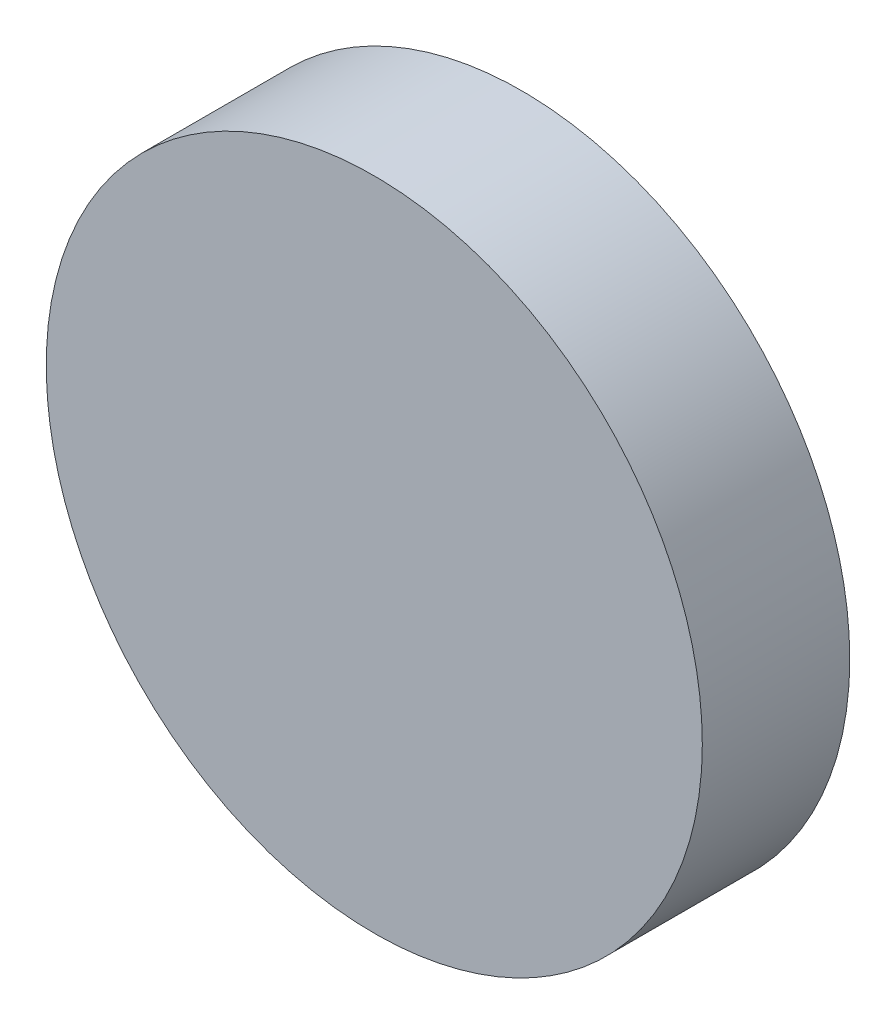
ISO-10303-21;
HEADER;
FILE_DESCRIPTION(('STEP AP214'),'2;1');
FILE_NAME('part.step','',(''),(''),'','','');
FILE_SCHEMA(('AUTOMOTIVE_DESIGN { 1 0 10303 214 1 1 1 1 }'));
ENDSEC;
DATA;
#1=APPLICATION_CONTEXT('core data for automotive mechanical design processes');
#2=APPLICATION_PROTOCOL_DEFINITION('international standard','automotive_design',2000,#1);
#3=PRODUCT_CONTEXT('',#1,'mechanical');
#4=PRODUCT('Part','Part','',(#3));
#5=PRODUCT_RELATED_PRODUCT_CATEGORY('part','',(#4));
#6=PRODUCT_DEFINITION_FORMATION('','',#4);
#7=PRODUCT_DEFINITION_CONTEXT('part definition',#1,'design');
#8=PRODUCT_DEFINITION('design','',#6,#7);
#9=PRODUCT_DEFINITION_SHAPE('','',#8);
#10=(LENGTH_UNIT() NAMED_UNIT(*) SI_UNIT(.MILLI.,.METRE.));
#11=(NAMED_UNIT(*) PLANE_ANGLE_UNIT() SI_UNIT($,.RADIAN.));
#12=(NAMED_UNIT(*) SI_UNIT($,.STERADIAN.) SOLID_ANGLE_UNIT());
#13=UNCERTAINTY_MEASURE_WITH_UNIT(LENGTH_MEASURE(1.E-05),#10,'distance_accuracy_value','');
#14=(GEOMETRIC_REPRESENTATION_CONTEXT(3) GLOBAL_UNCERTAINTY_ASSIGNED_CONTEXT((#13)) GLOBAL_UNIT_ASSIGNED_CONTEXT((#10,
#11,#12)) REPRESENTATION_CONTEXT('',''));
#15=CARTESIAN_POINT('',(0.,0.,0.));
#16=DIRECTION('',(0.,0.,1.));
#17=DIRECTION('',(1.,0.,0.));
#18=AXIS2_PLACEMENT_3D('',#15,#16,#17);
#19=CARTESIAN_POINT('',(-8.69832399369442E-06,8.21541058041416E-07,3.51484103151343));
#20=DIRECTION('',(1.,0.,0.));
#21=DIRECTION('',(0.,-1.,0.));
#22=AXIS2_PLACEMENT_3D('',#19,#20,#21);
#23=SPHERICAL_SURFACE('',#22,3.5326);
#24=CARTESIAN_POINT('',(1.298741301676,8.21541057580007E-07,0.229645269081607));
#25=CARTESIAN_POINT('',(1.298741301676,1.29875082154106,0.229645269081607));
#26=CARTESIAN_POINT('',(-8.69832399546053E-06,1.29875082154106,0.229645269081607));
#27=CARTESIAN_POINT('',(-1.298758698324,1.29875082154106,0.229645269081607));
#28=CARTESIAN_POINT('',(-1.298758698324,8.21541057739058E-07,0.229645269081607));
#29=CARTESIAN_POINT('',(-1.298758698324,-1.29874917845894,0.229645269081607));
#30=CARTESIAN_POINT('',(-8.69832399577864E-06,-1.29874917845894,0.229645269081607));
#31=CARTESIAN_POINT('',(1.298741301676,-1.29874917845894,0.229645269081607));
#32=CARTESIAN_POINT('',(1.298741301676,8.21541057580007E-07,0.229645269081607));
#33=(BOUNDED_CURVE() B_SPLINE_CURVE(2,(#24,#25,#26,#27,#28,#29,#30,#31,#32),.UNSPECIFIED.,.T.,
.F.) B_SPLINE_CURVE_WITH_KNOTS((3,2,2,2,3),(0.,1.5707963267949,3.14159265358979,
4.71238898038469,6.28318530717959),
.UNSPECIFIED.) CURVE() GEOMETRIC_REPRESENTATION_ITEM() RATIONAL_B_SPLINE_CURVE((1.,
0.707106781186548,1.,0.707106781186548,1.,0.707106781186548,1.,0.707106781186548,1.)) REPRESENTATION_ITEM(''));
#34=CARTESIAN_POINT('',(1.298741301676,8.21541057580007E-07,0.229645269081607));
#35=VERTEX_POINT('',#34);
#36=EDGE_CURVE('P0_E44',#35,#35,#33,.T.);
#37=ORIENTED_EDGE('',*,*,#36,.F.);
#38=EDGE_LOOP('',(#37));
#39=FACE_BOUND('',#38,.T.);
#40=ADVANCED_FACE('P0_F40',(#39),#23,.T.);
#41=CARTESIAN_POINT('',(-8.69832399554006E-06,2.86140682154106,0.813441031513429));
#42=DIRECTION('',(0.,0.,1.));
#43=DIRECTION('',(1.,0.,0.));
#44=AXIS2_PLACEMENT_3D('',#41,#42,#43);
#45=PLANE('',#44);
#46=CARTESIAN_POINT('',(1.298741301676,8.21541057580007E-07,0.813441031513429));
#47=CARTESIAN_POINT('',(1.298741301676,1.29875082154106,0.813441031513429));
#48=CARTESIAN_POINT('',(-8.69832399546053E-06,1.29875082154106,0.813441031513429));
#49=CARTESIAN_POINT('',(-1.298758698324,1.29875082154106,0.813441031513429));
#50=CARTESIAN_POINT('',(-1.298758698324,8.21541057739058E-07,0.813441031513429));
#51=CARTESIAN_POINT('',(-1.298758698324,-1.29874917845894,0.813441031513429));
#52=CARTESIAN_POINT('',(-8.69832399577864E-06,-1.29874917845894,0.813441031513429));
#53=CARTESIAN_POINT('',(1.298741301676,-1.29874917845894,0.813441031513429));
#54=CARTESIAN_POINT('',(1.298741301676,8.21541057580007E-07,0.813441031513429));
#55=(BOUNDED_CURVE() B_SPLINE_CURVE(2,(#46,#47,#48,#49,#50,#51,#52,#53,#54),.UNSPECIFIED.,.T.,
.F.) B_SPLINE_CURVE_WITH_KNOTS((3,2,2,2,3),(0.,1.5707963267949,3.14159265358979,
4.71238898038469,6.28318530717959),
.UNSPECIFIED.) CURVE() GEOMETRIC_REPRESENTATION_ITEM() RATIONAL_B_SPLINE_CURVE((1.,
0.707106781186548,1.,0.707106781186548,1.,0.707106781186548,1.,0.707106781186548,1.)) REPRESENTATION_ITEM(''));
#56=CARTESIAN_POINT('',(1.298741301676,8.21541057580007E-07,0.813441031513429));
#57=VERTEX_POINT('',#56);
#58=EDGE_CURVE('P0_E11',#57,#57,#55,.T.);
#59=ORIENTED_EDGE('',*,*,#58,.T.);
#60=EDGE_LOOP('',(#59));
#61=FACE_BOUND('',#60,.T.);
#62=ADVANCED_FACE('P0_F42',(#61),#45,.T.);
#63=CARTESIAN_POINT('',(-8.69832399548238E-06,8.2154105769536E-07,0.229645269081607));
#64=DIRECTION('',(0.,0.,1.));
#65=DIRECTION('',(1.,0.,0.));
#66=AXIS2_PLACEMENT_3D('',#63,#64,#65);
#67=CYLINDRICAL_SURFACE('',#66,1.29875);
#68=ORIENTED_EDGE('',*,*,#58,.F.);
#69=CARTESIAN_POINT('',(1.298741301676,8.21541057580007E-07,0.229645269081607));
#70=CARTESIAN_POINT('',(1.298741301676,8.21541057580007E-07,0.813441031513429));
#71=(BOUNDED_CURVE() B_SPLINE_CURVE(1,(#69,#70),.UNSPECIFIED.,.F.,
.F.) B_SPLINE_CURVE_WITH_KNOTS((2,2),(0.,1.),
.UNSPECIFIED.) CURVE() GEOMETRIC_REPRESENTATION_ITEM() RATIONAL_B_SPLINE_CURVE((1.,1.)) REPRESENTATION_ITEM(''));
#72=EDGE_CURVE('P0_E60',#35,#57,#71,.T.);
#73=ORIENTED_EDGE('',*,*,#72,.F.);
#74=ORIENTED_EDGE('',*,*,#36,.T.);
#75=ORIENTED_EDGE('',*,*,#72,.T.);
#76=EDGE_LOOP('',(#68,#73,#74,#75));
#77=FACE_BOUND('',#76,.T.);
#78=ADVANCED_FACE('P0_F59',(#77),#67,.T.);
#79=CLOSED_SHELL('',(#40,#62,#78));
#80=MANIFOLD_SOLID_BREP('P0_B2',#79);
#81=CARTESIAN_POINT('',(0.,0.,3.4));
#82=DIRECTION('',(1.,0.,0.));
#83=DIRECTION('',(0.,-1.,0.));
#84=AXIS2_PLACEMENT_3D('',#81,#82,#83);
#85=SPHERICAL_SURFACE('',#84,3.4);
#86=CARTESIAN_POINT('',(1.25,0.,0.238117649247525));
#87=CARTESIAN_POINT('',(1.25,1.25,0.238117649247525));
#88=CARTESIAN_POINT('',(0.,1.25,0.238117649247525));
#89=CARTESIAN_POINT('',(-1.25,1.25,0.238117649247525));
#90=CARTESIAN_POINT('',(-1.25,0.,0.238117649247525));
#91=CARTESIAN_POINT('',(-1.25,-1.25,0.238117649247525));
#92=CARTESIAN_POINT('',(0.,-1.25,0.238117649247525));
#93=CARTESIAN_POINT('',(1.25,-1.25,0.238117649247525));
#94=CARTESIAN_POINT('',(1.25,0.,0.238117649247525));
#95=(BOUNDED_CURVE() B_SPLINE_CURVE(2,(#86,#87,#88,#89,#90,#91,#92,#93,#94),.UNSPECIFIED.,.T.,
.F.) B_SPLINE_CURVE_WITH_KNOTS((3,2,2,2,3),(0.,1.5707963267949,3.14159265358979,
4.71238898038469,6.28318530717959),
.UNSPECIFIED.) CURVE() GEOMETRIC_REPRESENTATION_ITEM() RATIONAL_B_SPLINE_CURVE((1.,
0.707106781186548,1.,0.707106781186548,1.,0.707106781186548,1.,0.707106781186548,1.)) REPRESENTATION_ITEM(''));
#96=CARTESIAN_POINT('',(1.25,0.,0.238117649247525));
#97=VERTEX_POINT('',#96);
#98=EDGE_CURVE('P1_E20',#97,#97,#95,.T.);
#99=ORIENTED_EDGE('',*,*,#98,.F.);
#100=EDGE_LOOP('',(#99));
#101=FACE_BOUND('',#100,.T.);
#102=ADVANCED_FACE('P1_F16',(#101),#85,.T.);
#103=CARTESIAN_POINT('',(0.,2.754,0.8));
#104=DIRECTION('',(0.,0.,1.));
#105=DIRECTION('',(1.,0.,0.));
#106=AXIS2_PLACEMENT_3D('',#103,#104,#105);
#107=PLANE('',#106);
#108=CARTESIAN_POINT('',(1.25,0.,0.8));
#109=CARTESIAN_POINT('',(1.25,1.25,0.800000000000001));
#110=CARTESIAN_POINT('',(0.,1.25,0.8));
#111=CARTESIAN_POINT('',(-1.25,1.25,0.800000000000001));
#112=CARTESIAN_POINT('',(-1.25,0.,0.8));
#113=CARTESIAN_POINT('',(-1.25,-1.25,0.800000000000001));
#114=CARTESIAN_POINT('',(0.,-1.25,0.8));
#115=CARTESIAN_POINT('',(1.25,-1.25,0.800000000000001));
#116=CARTESIAN_POINT('',(1.25,0.,0.8));
#117=(BOUNDED_CURVE() B_SPLINE_CURVE(2,(#108,#109,#110,#111,#112,#113,#114,#115,#116),
.UNSPECIFIED.,.T.,.F.) B_SPLINE_CURVE_WITH_KNOTS((3,2,2,2,3),(0.,1.5707963267949,
3.14159265358979,4.71238898038469,6.28318530717959),
.UNSPECIFIED.) CURVE() GEOMETRIC_REPRESENTATION_ITEM() RATIONAL_B_SPLINE_CURVE((1.,
0.707106781186548,1.,0.707106781186548,1.,0.707106781186548,1.,0.707106781186548,1.)) REPRESENTATION_ITEM(''));
#118=CARTESIAN_POINT('',(1.25,0.,0.8));
#119=VERTEX_POINT('',#118);
#120=EDGE_CURVE('P1_E11',#119,#119,#117,.T.);
#121=ORIENTED_EDGE('',*,*,#120,.T.);
#122=EDGE_LOOP('',(#121));
#123=FACE_BOUND('',#122,.T.);
#124=ADVANCED_FACE('P1_F18',(#123),#107,.T.);
#125=CARTESIAN_POINT('',(0.,0.,0.238117649247525));
#126=DIRECTION('',(0.,0.,1.));
#127=DIRECTION('',(1.,0.,0.));
#128=AXIS2_PLACEMENT_3D('',#125,#126,#127);
#129=CYLINDRICAL_SURFACE('',#128,1.25);
#130=ORIENTED_EDGE('',*,*,#120,.F.);
#131=CARTESIAN_POINT('',(1.25,0.,0.238117649247525));
#132=CARTESIAN_POINT('',(1.25,0.,0.8));
#133=(BOUNDED_CURVE() B_SPLINE_CURVE(1,(#131,#132),.UNSPECIFIED.,.F.,
.F.) B_SPLINE_CURVE_WITH_KNOTS((2,2),(0.,1.),
.UNSPECIFIED.) CURVE() GEOMETRIC_REPRESENTATION_ITEM() RATIONAL_B_SPLINE_CURVE((1.,1.)) REPRESENTATION_ITEM(''));
#134=EDGE_CURVE('P1_E44',#97,#119,#133,.T.);
#135=ORIENTED_EDGE('',*,*,#134,.F.);
#136=ORIENTED_EDGE('',*,*,#98,.T.);
#137=ORIENTED_EDGE('',*,*,#134,.T.);
#138=EDGE_LOOP('',(#130,#135,#136,#137));
#139=FACE_BOUND('',#138,.T.);
#140=ADVANCED_FACE('P1_F43',(#139),#129,.T.);
#141=CLOSED_SHELL('',(#102,#124,#140));
#142=MANIFOLD_SOLID_BREP('P1_B1',#141);
#143=ADVANCED_BREP_SHAPE_REPRESENTATION('',(#18,#80,#142),#14);
#144=SHAPE_DEFINITION_REPRESENTATION(#9,#143);
ENDSEC;
END-ISO-10303-21;
